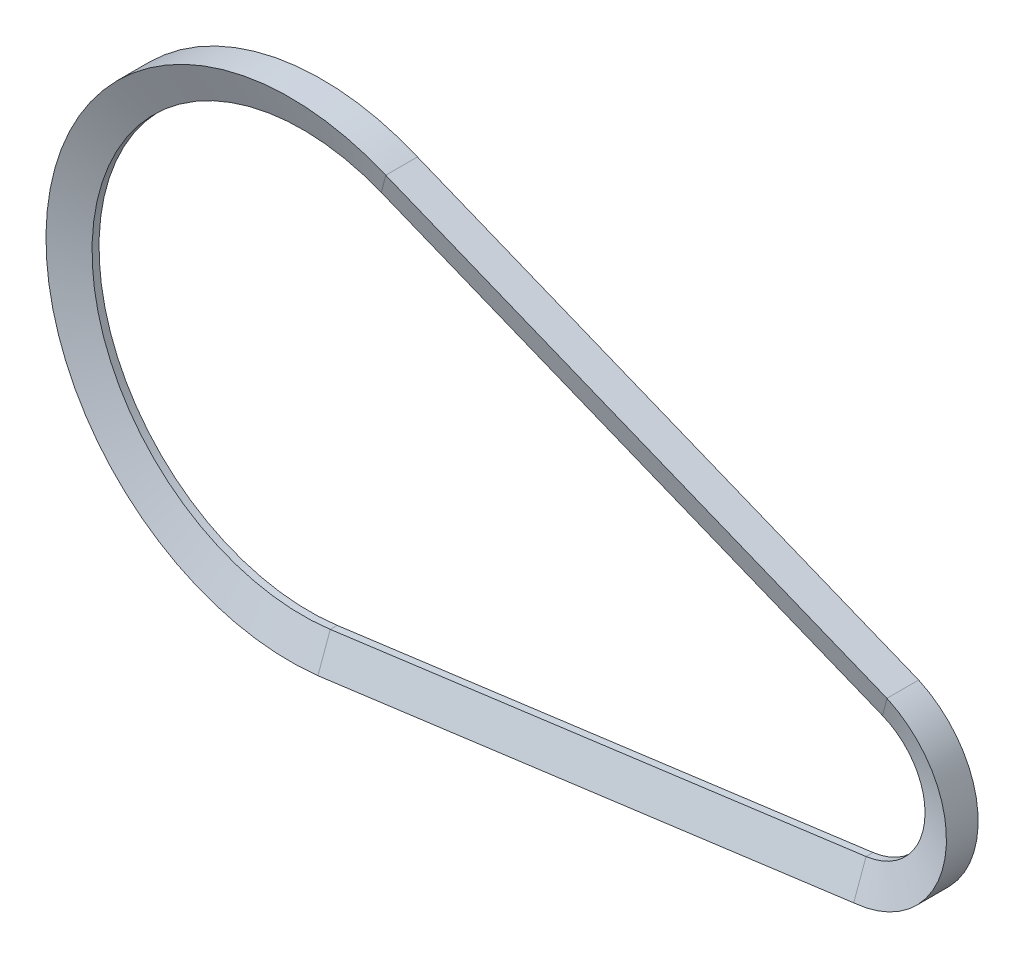
ISO-10303-21;
HEADER;
FILE_DESCRIPTION(('STEP AP214'),'2;1');
FILE_NAME('part.step','',(''),(''),'','','');
FILE_SCHEMA(('AUTOMOTIVE_DESIGN { 1 0 10303 214 1 1 1 1 }'));
ENDSEC;
DATA;
#1=APPLICATION_CONTEXT('core data for automotive mechanical design processes');
#2=APPLICATION_PROTOCOL_DEFINITION('international standard','automotive_design',2000,#1);
#3=PRODUCT_CONTEXT('',#1,'mechanical');
#4=PRODUCT('Part','Part','',(#3));
#5=PRODUCT_RELATED_PRODUCT_CATEGORY('part','',(#4));
#6=PRODUCT_DEFINITION_FORMATION('','',#4);
#7=PRODUCT_DEFINITION_CONTEXT('part definition',#1,'design');
#8=PRODUCT_DEFINITION('design','',#6,#7);
#9=PRODUCT_DEFINITION_SHAPE('','',#8);
#10=(LENGTH_UNIT() NAMED_UNIT(*) SI_UNIT(.MILLI.,.METRE.));
#11=(NAMED_UNIT(*) PLANE_ANGLE_UNIT() SI_UNIT($,.RADIAN.));
#12=(NAMED_UNIT(*) SI_UNIT($,.STERADIAN.) SOLID_ANGLE_UNIT());
#13=UNCERTAINTY_MEASURE_WITH_UNIT(LENGTH_MEASURE(1.E-05),#10,'distance_accuracy_value','');
#14=(GEOMETRIC_REPRESENTATION_CONTEXT(3) GLOBAL_UNCERTAINTY_ASSIGNED_CONTEXT((#13)) GLOBAL_UNIT_ASSIGNED_CONTEXT((#10,
#11,#12)) REPRESENTATION_CONTEXT('',''));
#15=CARTESIAN_POINT('',(0.,0.,0.));
#16=DIRECTION('',(0.,0.,1.));
#17=DIRECTION('',(1.,0.,0.));
#18=AXIS2_PLACEMENT_3D('',#15,#16,#17);
#19=CARTESIAN_POINT('',(0.,0.,0.));
#20=DIRECTION('',(0.,0.,1.));
#21=DIRECTION('',(1.,0.,0.));
#22=AXIS2_PLACEMENT_3D('',#19,#20,#21);
#23=CYLINDRICAL_SURFACE('',#22,53.94370356931);
#24=CARTESIAN_POINT('',(0.,0.,3.5));
#25=DIRECTION('',(0.,0.,1.));
#26=DIRECTION('',(0.391384684427716,0.920227161517969,0.));
#27=AXIS2_PLACEMENT_3D('',#24,#25,#26);
#28=CIRCLE('',#27,53.94370356931);
#29=CARTESIAN_POINT('',(21.1127393983367,49.6404612173529,3.5));
#30=VERTEX_POINT('',#29);
#31=CARTESIAN_POINT('',(6.12472985088943,-53.5948769849061,3.5));
#32=VERTEX_POINT('',#31);
#33=EDGE_CURVE('E11',#30,#32,#28,.T.);
#34=ORIENTED_EDGE('',*,*,#33,.F.);
#35=DIRECTION('',(0.,0.,-1.));
#36=VECTOR('',#35,1.);
#37=CARTESIAN_POINT('',(21.1127393983366,49.6404612173529,-3.5));
#38=LINE('',#37,#36);
#39=CARTESIAN_POINT('',(21.1127393983367,49.6404612173529,-3.5));
#40=VERTEX_POINT('',#39);
#41=EDGE_CURVE('E44',#30,#40,#38,.T.);
#42=ORIENTED_EDGE('',*,*,#41,.T.);
#43=CARTESIAN_POINT('',(0.,0.,-3.5));
#44=DIRECTION('',(0.,0.,1.));
#45=DIRECTION('',(0.391384684427716,0.920227161517969,0.));
#46=AXIS2_PLACEMENT_3D('',#43,#44,#45);
#47=CIRCLE('',#46,53.94370356931);
#48=CARTESIAN_POINT('',(6.12472985088943,-53.5948769849061,-3.5));
#49=VERTEX_POINT('',#48);
#50=EDGE_CURVE('E127',#40,#49,#47,.T.);
#51=ORIENTED_EDGE('',*,*,#50,.T.);
#52=DIRECTION('',(0.,0.,-1.));
#53=VECTOR('',#52,1.);
#54=CARTESIAN_POINT('',(6.12472985088943,-53.5948769849061,-3.5));
#55=LINE('',#54,#53);
#56=EDGE_CURVE('E130',#32,#49,#55,.T.);
#57=ORIENTED_EDGE('',*,*,#56,.F.);
#58=EDGE_LOOP('',(#34,#42,#51,#57));
#59=FACE_BOUND('',#58,.T.);
#60=ADVANCED_FACE('F41',(#59),#23,.T.);
#61=CARTESIAN_POINT('',(17.412721367423,43.1166688715686,0.770223243003512));
#62=CARTESIAN_POINT('',(-13.3508763277611,55.5405867888213,0.770223243003512));
#63=CARTESIAN_POINT('',(-41.9674038383494,38.7522863149345,0.770223243003512));
#64=CARTESIAN_POINT('',(-46.1321783681313,5.83713277311049,0.770223243003512));
#65=CARTESIAN_POINT('',(-50.2969528979131,-27.0780207687135,0.770223243003512));
#66=CARTESIAN_POINT('',(-26.763809279918,-50.4648510588701,0.770223243003512));
#67=CARTESIAN_POINT('',(6.12472985088942,-46.0948769849061,0.770223243003512));
#68=CARTESIAN_POINT('',(21.1127393983366,49.6404612173529,3.5));
#69=CARTESIAN_POINT('',(-14.3055621138431,64.7043295098771,3.5));
#70=CARTESIAN_POINT('',(-47.8541018353016,45.8397676941361,3.5));
#71=CARTESIAN_POINT('',(-53.3840209820254,7.75044892662745,3.5));
#72=CARTESIAN_POINT('',(-58.9139401287492,-30.3388698408812,3.5));
#73=CARTESIAN_POINT('',(-32.1150339629088,-57.9648510588701,3.5));
#74=CARTESIAN_POINT('',(6.12472985088942,-53.5948769849061,3.5));
#75=(BOUNDED_SURFACE() B_SPLINE_SURFACE(1,3,((#61,#62,#63,#64,#65,#66,#67),(#68,#69,#70,#71,#72,
#73,#74)),.UNSPECIFIED.,.F.,.F.,.F.) B_SPLINE_SURFACE_WITH_KNOTS((2,2),(4,3,4),(0.,1.),(0.,0.5,
1.),.UNSPECIFIED.) GEOMETRIC_REPRESENTATION_ITEM() RATIONAL_B_SPLINE_SURFACE(((1.,
0.740188803038642,0.740188803038642,1.,0.740188803038642,0.740188803038642,1.),(1.,
0.740188803038642,0.740188803038642,1.,0.740188803038642,0.740188803038642,1.))) REPRESENTATION_ITEM('') SURFACE());
#76=CARTESIAN_POINT('',(0.,0.,0.770223243003512));
#77=DIRECTION('',(0.,0.,1.));
#78=DIRECTION('',(0.374467126181139,0.927240190786421,0.));
#79=AXIS2_PLACEMENT_3D('',#76,#77,#78);
#80=CIRCLE('',#79,46.5);
#81=CARTESIAN_POINT('',(17.412721367423,43.1166688715686,0.770223243003512));
#82=VERTEX_POINT('',#81);
#83=CARTESIAN_POINT('',(6.12472985088943,-46.0948769849061,0.770223243003512));
#84=VERTEX_POINT('',#83);
#85=EDGE_CURVE('E50',#82,#84,#80,.T.);
#86=DIRECTION('',(0.463583952056588,0.817381270249745,0.342020143325665));
#87=VECTOR('',#86,1.);
#88=CARTESIAN_POINT('',(21.1127393983366,49.6404612173529,3.5));
#89=LINE('',#88,#87);
#90=EDGE_CURVE('E215',#82,#30,#89,.T.);
#91=DIRECTION('',(0.,-0.93969262078591,0.342020143325665));
#92=VECTOR('',#91,1.);
#93=CARTESIAN_POINT('',(6.12472985088943,-53.5948769849061,3.5));
#94=LINE('',#93,#92);
#95=EDGE_CURVE('E158',#84,#32,#94,.T.);
#96=ORIENTED_EDGE('',*,*,#85,.F.);
#97=ORIENTED_EDGE('',*,*,#90,.T.);
#98=ORIENTED_EDGE('',*,*,#33,.T.);
#99=ORIENTED_EDGE('',*,*,#95,.F.);
#100=EDGE_LOOP('',(#96,#97,#98,#99));
#101=FACE_BOUND('',#100,.T.);
#102=ADVANCED_FACE('F266',(#101),#75,.T.);
#103=CARTESIAN_POINT('',(0.,0.,0.));
#104=DIRECTION('',(0.,0.,1.));
#105=DIRECTION('',(1.,0.,0.));
#106=AXIS2_PLACEMENT_3D('',#103,#104,#105);
#107=CYLINDRICAL_SURFACE('',#106,46.5);
#108=CARTESIAN_POINT('',(0.,0.,-0.770223243003512));
#109=DIRECTION('',(0.,0.,1.));
#110=DIRECTION('',(0.374467126181139,0.927240190786421,0.));
#111=AXIS2_PLACEMENT_3D('',#108,#109,#110);
#112=CIRCLE('',#111,46.5);
#113=CARTESIAN_POINT('',(17.412721367423,43.1166688715686,-0.770223243003512));
#114=VERTEX_POINT('',#113);
#115=CARTESIAN_POINT('',(6.12472985088943,-46.0948769849061,-0.770223243003512));
#116=VERTEX_POINT('',#115);
#117=EDGE_CURVE('E137',#114,#116,#112,.T.);
#118=ORIENTED_EDGE('',*,*,#117,.F.);
#119=DIRECTION('',(0.,0.,1.));
#120=VECTOR('',#119,1.);
#121=CARTESIAN_POINT('',(17.412721367423,43.1166688715686,0.770223243003512));
#122=LINE('',#121,#120);
#123=EDGE_CURVE('E191',#114,#82,#122,.T.);
#124=ORIENTED_EDGE('',*,*,#123,.T.);
#125=ORIENTED_EDGE('',*,*,#85,.T.);
#126=DIRECTION('',(0.,0.,1.));
#127=VECTOR('',#126,1.);
#128=CARTESIAN_POINT('',(6.12472985088943,-46.0948769849061,0.770223243003512));
#129=LINE('',#128,#127);
#130=EDGE_CURVE('E164',#116,#84,#129,.T.);
#131=ORIENTED_EDGE('',*,*,#130,.F.);
#132=EDGE_LOOP('',(#118,#124,#125,#131));
#133=FACE_BOUND('',#132,.T.);
#134=ADVANCED_FACE('F262',(#133),#107,.F.);
#135=CARTESIAN_POINT('',(131.817024923631,4.93239520758062,-3.5));
#136=DIRECTION('',(0.374467126181139,0.927240190786421,0.));
#137=DIRECTION('',(-0.927240190786422,0.374467126181139,0.));
#138=AXIS2_PLACEMENT_3D('',#135,#136,#137);
#139=PLANE('',#138);
#140=ORIENTED_EDGE('',*,*,#41,.F.);
#141=DIRECTION('',(-0.927240190786421,0.374467126181139,0.));
#142=VECTOR('',#141,1.);
#143=CARTESIAN_POINT('',(131.817024923631,4.93239520758062,3.5));
#144=LINE('',#143,#142);
#145=CARTESIAN_POINT('',(131.817024923631,4.93239520758063,3.5));
#146=VERTEX_POINT('',#145);
#147=EDGE_CURVE('E58',#146,#30,#144,.T.);
#148=ORIENTED_EDGE('',*,*,#147,.F.);
#149=DIRECTION('',(0.,0.,-1.));
#150=VECTOR('',#149,1.);
#151=CARTESIAN_POINT('',(131.817024923631,4.93239520758063,-3.5));
#152=LINE('',#151,#150);
#153=CARTESIAN_POINT('',(131.817024923631,4.93239520758063,-3.5));
#154=VERTEX_POINT('',#153);
#155=EDGE_CURVE('E197',#146,#154,#152,.T.);
#156=ORIENTED_EDGE('',*,*,#155,.T.);
#157=DIRECTION('',(-0.927240190786421,0.374467126181139,0.));
#158=VECTOR('',#157,1.);
#159=CARTESIAN_POINT('',(131.817024923631,4.93239520758062,-3.5));
#160=LINE('',#159,#158);
#161=EDGE_CURVE('E194',#154,#40,#160,.T.);
#162=ORIENTED_EDGE('',*,*,#161,.T.);
#163=EDGE_LOOP('',(#140,#148,#156,#162));
#164=FACE_BOUND('',#163,.T.);
#165=ADVANCED_FACE('F241',(#164),#139,.T.);
#166=CARTESIAN_POINT('',(131.817024923631,4.93239520758062,3.5));
#167=DIRECTION('',(-0.129067730873883,-0.319592239298408,0.93872377269743));
#168=DIRECTION('',(0.,-0.946641691748174,-0.322287926308379));
#169=AXIS2_PLACEMENT_3D('',#166,#167,#168);
#170=PLANE('',#169);
#171=ORIENTED_EDGE('',*,*,#147,.T.);
#172=ORIENTED_EDGE('',*,*,#90,.F.);
#173=DIRECTION('',(-0.927240190786421,0.374467126181139,0.));
#174=VECTOR('',#173,1.);
#175=CARTESIAN_POINT('',(128.117006892717,-1.59139713820366,0.770223243003512));
#176=LINE('',#175,#174);
#177=CARTESIAN_POINT('',(128.117006892717,-1.59139713820365,0.770223243003512));
#178=VERTEX_POINT('',#177);
#179=EDGE_CURVE('E67',#178,#82,#176,.T.);
#180=ORIENTED_EDGE('',*,*,#179,.F.);
#181=DIRECTION('',(0.463583952056588,0.817381270249744,0.342020143325665));
#182=VECTOR('',#181,1.);
#183=CARTESIAN_POINT('',(131.817024923631,4.93239520758063,3.5));
#184=LINE('',#183,#182);
#185=EDGE_CURVE('E211',#178,#146,#184,.T.);
#186=ORIENTED_EDGE('',*,*,#185,.T.);
#187=EDGE_LOOP('',(#171,#172,#180,#186));
#188=FACE_BOUND('',#187,.T.);
#189=ADVANCED_FACE('F252',(#188),#170,.T.);
#190=CARTESIAN_POINT('',(128.117006892717,-1.59139713820366,0.770223243003512));
#191=DIRECTION('',(-0.374467126181139,-0.927240190786421,0.));
#192=DIRECTION('',(0.927240190786421,-0.374467126181139,0.));
#193=AXIS2_PLACEMENT_3D('',#190,#191,#192);
#194=PLANE('',#193);
#195=ORIENTED_EDGE('',*,*,#179,.T.);
#196=ORIENTED_EDGE('',*,*,#123,.F.);
#197=DIRECTION('',(-0.927240190786421,0.374467126181139,0.));
#198=VECTOR('',#197,1.);
#199=CARTESIAN_POINT('',(128.117006892717,-1.59139713820366,-0.770223243003512));
#200=LINE('',#199,#198);
#201=CARTESIAN_POINT('',(128.117006892717,-1.59139713820365,-0.770223243003512));
#202=VERTEX_POINT('',#201);
#203=EDGE_CURVE('E95',#202,#114,#200,.T.);
#204=ORIENTED_EDGE('',*,*,#203,.F.);
#205=DIRECTION('',(0.,0.,1.));
#206=VECTOR('',#205,1.);
#207=CARTESIAN_POINT('',(128.117006892717,-1.59139713820365,0.770223243003512));
#208=LINE('',#207,#206);
#209=EDGE_CURVE('E183',#202,#178,#208,.T.);
#210=ORIENTED_EDGE('',*,*,#209,.T.);
#211=EDGE_LOOP('',(#195,#196,#204,#210));
#212=FACE_BOUND('',#211,.T.);
#213=ADVANCED_FACE('F254',(#212),#194,.T.);
#214=CARTESIAN_POINT('',(128.117006892717,-1.59139713820366,-0.770223243003512));
#215=DIRECTION('',(-0.129067730873883,-0.319592239298409,-0.93872377269743));
#216=DIRECTION('',(0.,0.946641691748174,-0.322287926308379));
#217=AXIS2_PLACEMENT_3D('',#214,#215,#216);
#218=PLANE('',#217);
#219=ORIENTED_EDGE('',*,*,#203,.T.);
#220=DIRECTION('',(-0.463583952056588,-0.817381270249745,0.342020143325666));
#221=VECTOR('',#220,1.);
#222=CARTESIAN_POINT('',(17.412721367423,43.1166688715686,-0.770223243003512));
#223=LINE('',#222,#221);
#224=EDGE_CURVE('E188',#40,#114,#223,.T.);
#225=ORIENTED_EDGE('',*,*,#224,.F.);
#226=ORIENTED_EDGE('',*,*,#161,.F.);
#227=DIRECTION('',(-0.463583952056588,-0.817381270249744,0.342020143325666));
#228=VECTOR('',#227,1.);
#229=CARTESIAN_POINT('',(128.117006892717,-1.59139713820365,-0.770223243003512));
#230=LINE('',#229,#228);
#231=EDGE_CURVE('E176',#154,#202,#230,.T.);
#232=ORIENTED_EDGE('',*,*,#231,.T.);
#233=EDGE_LOOP('',(#219,#225,#226,#232));
#234=FACE_BOUND('',#233,.T.);
#235=ADVANCED_FACE('F260',(#234),#218,.T.);
#236=CARTESIAN_POINT('',(122.5,-15.5,0.));
#237=DIRECTION('',(0.,0.,1.));
#238=DIRECTION('',(1.,0.,0.));
#239=AXIS2_PLACEMENT_3D('',#236,#237,#238);
#240=CYLINDRICAL_SURFACE('',#239,22.4563961344273);
#241=ORIENTED_EDGE('',*,*,#155,.F.);
#242=CARTESIAN_POINT('',(122.5,-15.5,3.5));
#243=DIRECTION('',(0.,0.,1.));
#244=DIRECTION('',(0.0879802482513943,-0.996122219367495,0.));
#245=AXIS2_PLACEMENT_3D('',#242,#243,#244);
#246=CIRCLE('',#245,22.4563961344273);
#247=CARTESIAN_POINT('',(124.475719306739,-37.8693151564213,3.5));
#248=VERTEX_POINT('',#247);
#249=EDGE_CURVE('E228',#248,#146,#246,.T.);
#250=ORIENTED_EDGE('',*,*,#249,.F.);
#251=DIRECTION('',(0.,0.,-1.));
#252=VECTOR('',#251,1.);
#253=CARTESIAN_POINT('',(124.475719306739,-37.8693151564214,-3.5));
#254=LINE('',#253,#252);
#255=CARTESIAN_POINT('',(124.475719306739,-37.8693151564213,-3.5));
#256=VERTEX_POINT('',#255);
#257=EDGE_CURVE('E187',#248,#256,#254,.T.);
#258=ORIENTED_EDGE('',*,*,#257,.T.);
#259=CARTESIAN_POINT('',(122.5,-15.5,-3.5));
#260=DIRECTION('',(0.,0.,1.));
#261=DIRECTION('',(0.0879802482513943,-0.996122219367495,0.));
#262=AXIS2_PLACEMENT_3D('',#259,#260,#261);
#263=CIRCLE('',#262,22.4563961344273);
#264=EDGE_CURVE('E180',#256,#154,#263,.T.);
#265=ORIENTED_EDGE('',*,*,#264,.T.);
#266=EDGE_LOOP('',(#241,#250,#258,#265));
#267=FACE_BOUND('',#266,.T.);
#268=ADVANCED_FACE('F246',(#267),#240,.T.);
#269=CARTESIAN_POINT('',(124.475719306739,-30.3693151564213,0.770223243003512));
#270=CARTESIAN_POINT('',(143.515788829221,-27.8394183480289,0.770223243003512));
#271=CARTESIAN_POINT('',(145.926890042233,-8.78394101937949,0.770223243003512));
#272=CARTESIAN_POINT('',(128.117006892717,-1.59139713820364,0.770223243003512));
#273=CARTESIAN_POINT('',(124.475719306739,-37.8693151564213,3.5));
#274=CARTESIAN_POINT('',(153.119494172499,-35.3394183480289,3.5));
#275=CARTESIAN_POINT('',(157.980585327767,-6.99799973142355,3.5));
#276=CARTESIAN_POINT('',(131.817024923631,4.93239520758063,3.5));
#277=(BOUNDED_SURFACE() B_SPLINE_SURFACE(1,3,((#269,#270,#271,#272),(#273,#274,#275,#276)),
.UNSPECIFIED.,.F.,.F.,.F.) B_SPLINE_SURFACE_WITH_KNOTS((2,2),(4,4),(0.,1.),(0.,1.),
.UNSPECIFIED.) GEOMETRIC_REPRESENTATION_ITEM() RATIONAL_B_SPLINE_SURFACE(((1.,0.503405880312619,
0.503405880312619,1.),(1.,0.503405880312619,0.503405880312619,1.))) REPRESENTATION_ITEM('') SURFACE());
#278=CARTESIAN_POINT('',(122.5,-15.5,0.770223243003512));
#279=DIRECTION('',(0.,0.,1.));
#280=DIRECTION('',(0.131714620449237,-0.991287677094754,0.));
#281=AXIS2_PLACEMENT_3D('',#278,#279,#280);
#282=CIRCLE('',#281,15.);
#283=CARTESIAN_POINT('',(124.475719306739,-30.3693151564213,0.770223243003512));
#284=VERTEX_POINT('',#283);
#285=EDGE_CURVE('E108',#284,#178,#282,.T.);
#286=DIRECTION('',(0.,-0.93969262078591,0.342020143325665));
#287=VECTOR('',#286,1.);
#288=CARTESIAN_POINT('',(124.475719306739,-37.8693151564214,3.5));
#289=LINE('',#288,#287);
#290=EDGE_CURVE('E206',#284,#248,#289,.T.);
#291=ORIENTED_EDGE('',*,*,#249,.T.);
#292=ORIENTED_EDGE('',*,*,#185,.F.);
#293=ORIENTED_EDGE('',*,*,#285,.F.);
#294=ORIENTED_EDGE('',*,*,#290,.T.);
#295=EDGE_LOOP('',(#291,#292,#293,#294));
#296=FACE_BOUND('',#295,.T.);
#297=ADVANCED_FACE('F251',(#296),#277,.T.);
#298=CARTESIAN_POINT('',(122.5,-15.5,0.));
#299=DIRECTION('',(0.,0.,1.));
#300=DIRECTION('',(1.,0.,0.));
#301=AXIS2_PLACEMENT_3D('',#298,#299,#300);
#302=CYLINDRICAL_SURFACE('',#301,15.);
#303=ORIENTED_EDGE('',*,*,#285,.T.);
#304=ORIENTED_EDGE('',*,*,#209,.F.);
#305=CARTESIAN_POINT('',(122.5,-15.5,-0.770223243003512));
#306=DIRECTION('',(0.,0.,1.));
#307=DIRECTION('',(0.131714620449237,-0.991287677094754,0.));
#308=AXIS2_PLACEMENT_3D('',#305,#306,#307);
#309=CIRCLE('',#308,15.);
#310=CARTESIAN_POINT('',(124.475719306739,-30.3693151564213,-0.770223243003512));
#311=VERTEX_POINT('',#310);
#312=EDGE_CURVE('E114',#311,#202,#309,.T.);
#313=ORIENTED_EDGE('',*,*,#312,.F.);
#314=DIRECTION('',(0.,0.,1.));
#315=VECTOR('',#314,1.);
#316=CARTESIAN_POINT('',(124.475719306739,-30.3693151564213,0.770223243003512));
#317=LINE('',#316,#315);
#318=EDGE_CURVE('E174',#311,#284,#317,.T.);
#319=ORIENTED_EDGE('',*,*,#318,.T.);
#320=EDGE_LOOP('',(#303,#304,#313,#319));
#321=FACE_BOUND('',#320,.T.);
#322=ADVANCED_FACE('F291',(#321),#302,.F.);
#323=CARTESIAN_POINT('',(124.475719306739,-37.8693151564213,-3.5));
#324=CARTESIAN_POINT('',(153.119494172499,-35.3394183480289,-3.5));
#325=CARTESIAN_POINT('',(157.980585327767,-6.99799973142355,-3.5));
#326=CARTESIAN_POINT('',(131.817024923631,4.93239520758063,-3.5));
#327=CARTESIAN_POINT('',(124.475719306739,-30.3693151564213,-0.770223243003512));
#328=CARTESIAN_POINT('',(143.515788829221,-27.8394183480289,-0.770223243003512));
#329=CARTESIAN_POINT('',(145.926890042233,-8.78394101937949,-0.770223243003512));
#330=CARTESIAN_POINT('',(128.117006892717,-1.59139713820364,-0.770223243003512));
#331=(BOUNDED_SURFACE() B_SPLINE_SURFACE(1,3,((#323,#324,#325,#326),(#327,#328,#329,#330)),
.UNSPECIFIED.,.F.,.F.,.F.) B_SPLINE_SURFACE_WITH_KNOTS((2,2),(4,4),(0.,1.),(0.,1.),
.UNSPECIFIED.) GEOMETRIC_REPRESENTATION_ITEM() RATIONAL_B_SPLINE_SURFACE(((1.,0.503405880312619,
0.503405880312619,1.),(1.,0.503405880312619,0.503405880312619,1.))) REPRESENTATION_ITEM('') SURFACE());
#332=DIRECTION('',(0.,0.939692620785909,0.342020143325666));
#333=VECTOR('',#332,1.);
#334=CARTESIAN_POINT('',(124.475719306739,-30.3693151564213,-0.770223243003512));
#335=LINE('',#334,#333);
#336=EDGE_CURVE('E148',#256,#311,#335,.T.);
#337=ORIENTED_EDGE('',*,*,#312,.T.);
#338=ORIENTED_EDGE('',*,*,#231,.F.);
#339=ORIENTED_EDGE('',*,*,#264,.F.);
#340=ORIENTED_EDGE('',*,*,#336,.T.);
#341=EDGE_LOOP('',(#337,#338,#339,#340));
#342=FACE_BOUND('',#341,.T.);
#343=ADVANCED_FACE('F244',(#342),#331,.T.);
#344=CARTESIAN_POINT('',(6.12472985088943,-53.5948769849061,-3.5));
#345=DIRECTION('',(0.131714620449235,-0.991287677094754,0.));
#346=DIRECTION('',(0.991287677094755,0.131714620449235,0.));
#347=AXIS2_PLACEMENT_3D('',#344,#345,#346);
#348=PLANE('',#347);
#349=ORIENTED_EDGE('',*,*,#257,.F.);
#350=DIRECTION('',(0.991287677094754,0.131714620449235,0.));
#351=VECTOR('',#350,1.);
#352=CARTESIAN_POINT('',(6.12472985088943,-53.5948769849061,3.5));
#353=LINE('',#352,#351);
#354=EDGE_CURVE('E156',#32,#248,#353,.T.);
#355=ORIENTED_EDGE('',*,*,#354,.F.);
#356=ORIENTED_EDGE('',*,*,#56,.T.);
#357=DIRECTION('',(0.991287677094754,0.131714620449235,0.));
#358=VECTOR('',#357,1.);
#359=CARTESIAN_POINT('',(6.12472985088943,-53.5948769849061,-3.5));
#360=LINE('',#359,#358);
#361=EDGE_CURVE('E143',#49,#256,#360,.T.);
#362=ORIENTED_EDGE('',*,*,#361,.T.);
#363=EDGE_LOOP('',(#349,#355,#356,#362));
#364=FACE_BOUND('',#363,.T.);
#365=ADVANCED_FACE('F154',(#364),#348,.T.);
#366=CARTESIAN_POINT('',(6.12472985088943,-53.5948769849061,3.5));
#367=DIRECTION('',(-0.0453981297575215,0.341667511459933,0.93872377269743));
#368=DIRECTION('',(0.,-0.93969262078591,0.342020143325665));
#369=AXIS2_PLACEMENT_3D('',#366,#367,#368);
#370=PLANE('',#369);
#371=ORIENTED_EDGE('',*,*,#354,.T.);
#372=ORIENTED_EDGE('',*,*,#290,.F.);
#373=DIRECTION('',(0.991287677094754,0.131714620449235,0.));
#374=VECTOR('',#373,1.);
#375=CARTESIAN_POINT('',(6.12472985088943,-46.0948769849061,0.770223243003512));
#376=LINE('',#375,#374);
#377=EDGE_CURVE('E202',#84,#284,#376,.T.);
#378=ORIENTED_EDGE('',*,*,#377,.F.);
#379=ORIENTED_EDGE('',*,*,#95,.T.);
#380=EDGE_LOOP('',(#371,#372,#378,#379));
#381=FACE_BOUND('',#380,.T.);
#382=ADVANCED_FACE('F248',(#381),#370,.T.);
#383=CARTESIAN_POINT('',(6.12472985088943,-46.0948769849061,0.770223243003512));
#384=DIRECTION('',(-0.131714620449235,0.991287677094754,0.));
#385=DIRECTION('',(-0.991287677094754,-0.131714620449235,0.));
#386=AXIS2_PLACEMENT_3D('',#383,#384,#385);
#387=PLANE('',#386);
#388=ORIENTED_EDGE('',*,*,#377,.T.);
#389=ORIENTED_EDGE('',*,*,#318,.F.);
#390=DIRECTION('',(0.991287677094754,0.131714620449235,0.));
#391=VECTOR('',#390,1.);
#392=CARTESIAN_POINT('',(6.12472985088943,-46.0948769849061,-0.770223243003512));
#393=LINE('',#392,#391);
#394=EDGE_CURVE('E172',#116,#311,#393,.T.);
#395=ORIENTED_EDGE('',*,*,#394,.F.);
#396=ORIENTED_EDGE('',*,*,#130,.T.);
#397=EDGE_LOOP('',(#388,#389,#395,#396));
#398=FACE_BOUND('',#397,.T.);
#399=ADVANCED_FACE('F304',(#398),#387,.T.);
#400=CARTESIAN_POINT('',(6.12472985088943,-46.0948769849061,-0.770223243003512));
#401=DIRECTION('',(-0.0453981297575215,0.341667511459933,-0.93872377269743));
#402=DIRECTION('',(0.,0.93969262078591,0.342020143325666));
#403=AXIS2_PLACEMENT_3D('',#400,#401,#402);
#404=PLANE('',#403);
#405=ORIENTED_EDGE('',*,*,#394,.T.);
#406=ORIENTED_EDGE('',*,*,#336,.F.);
#407=ORIENTED_EDGE('',*,*,#361,.F.);
#408=DIRECTION('',(0.,0.939692620785909,0.342020143325666));
#409=VECTOR('',#408,1.);
#410=CARTESIAN_POINT('',(6.12472985088943,-46.0948769849061,-0.770223243003512));
#411=LINE('',#410,#409);
#412=EDGE_CURVE('E146',#49,#116,#411,.T.);
#413=ORIENTED_EDGE('',*,*,#412,.T.);
#414=EDGE_LOOP('',(#405,#406,#407,#413));
#415=FACE_BOUND('',#414,.T.);
#416=ADVANCED_FACE('F145',(#415),#404,.T.);
#417=CARTESIAN_POINT('',(21.1127393983366,49.6404612173529,-3.5));
#418=CARTESIAN_POINT('',(-14.3055621138431,64.7043295098771,-3.5));
#419=CARTESIAN_POINT('',(-47.8541018353016,45.8397676941361,-3.5));
#420=CARTESIAN_POINT('',(-53.3840209820254,7.75044892662745,-3.5));
#421=CARTESIAN_POINT('',(-58.9139401287492,-30.3388698408812,-3.5));
#422=CARTESIAN_POINT('',(-32.1150339629088,-57.9648510588701,-3.5));
#423=CARTESIAN_POINT('',(6.12472985088942,-53.5948769849061,-3.5));
#424=CARTESIAN_POINT('',(17.412721367423,43.1166688715686,-0.770223243003512));
#425=CARTESIAN_POINT('',(-13.3508763277611,55.5405867888213,-0.770223243003512));
#426=CARTESIAN_POINT('',(-41.9674038383494,38.7522863149345,-0.770223243003512));
#427=CARTESIAN_POINT('',(-46.1321783681313,5.83713277311049,-0.770223243003512));
#428=CARTESIAN_POINT('',(-50.2969528979131,-27.0780207687135,-0.770223243003512));
#429=CARTESIAN_POINT('',(-26.763809279918,-50.4648510588701,-0.770223243003512));
#430=CARTESIAN_POINT('',(6.12472985088942,-46.0948769849061,-0.770223243003512));
#431=(BOUNDED_SURFACE() B_SPLINE_SURFACE(1,3,((#417,#418,#419,#420,#421,#422,#423),(#424,#425,
#426,#427,#428,#429,#430)),.UNSPECIFIED.,.F.,.F.,.F.) B_SPLINE_SURFACE_WITH_KNOTS((2,2),(4,3,4),
(0.,1.),(0.,0.5,1.),
.UNSPECIFIED.) GEOMETRIC_REPRESENTATION_ITEM() RATIONAL_B_SPLINE_SURFACE(((1.,0.740188803038642,
0.740188803038642,1.,0.740188803038642,0.740188803038642,1.),(1.,0.740188803038642,
0.740188803038642,1.,0.740188803038642,0.740188803038642,1.))) REPRESENTATION_ITEM('') SURFACE());
#432=ORIENTED_EDGE('',*,*,#224,.T.);
#433=ORIENTED_EDGE('',*,*,#117,.T.);
#434=ORIENTED_EDGE('',*,*,#412,.F.);
#435=ORIENTED_EDGE('',*,*,#50,.F.);
#436=EDGE_LOOP('',(#432,#433,#434,#435));
#437=FACE_BOUND('',#436,.T.);
#438=ADVANCED_FACE('F160',(#437),#431,.T.);
#439=CLOSED_SHELL('',(#60,#102,#134,#165,#189,#213,#235,#268,#297,#322,#343,#365,#382,#399,#416,#438));
#440=MANIFOLD_SOLID_BREP('B2',#439);
#441=ADVANCED_BREP_SHAPE_REPRESENTATION('',(#18,#440),#14);
#442=SHAPE_DEFINITION_REPRESENTATION(#9,#441);
ENDSEC;
END-ISO-10303-21;
